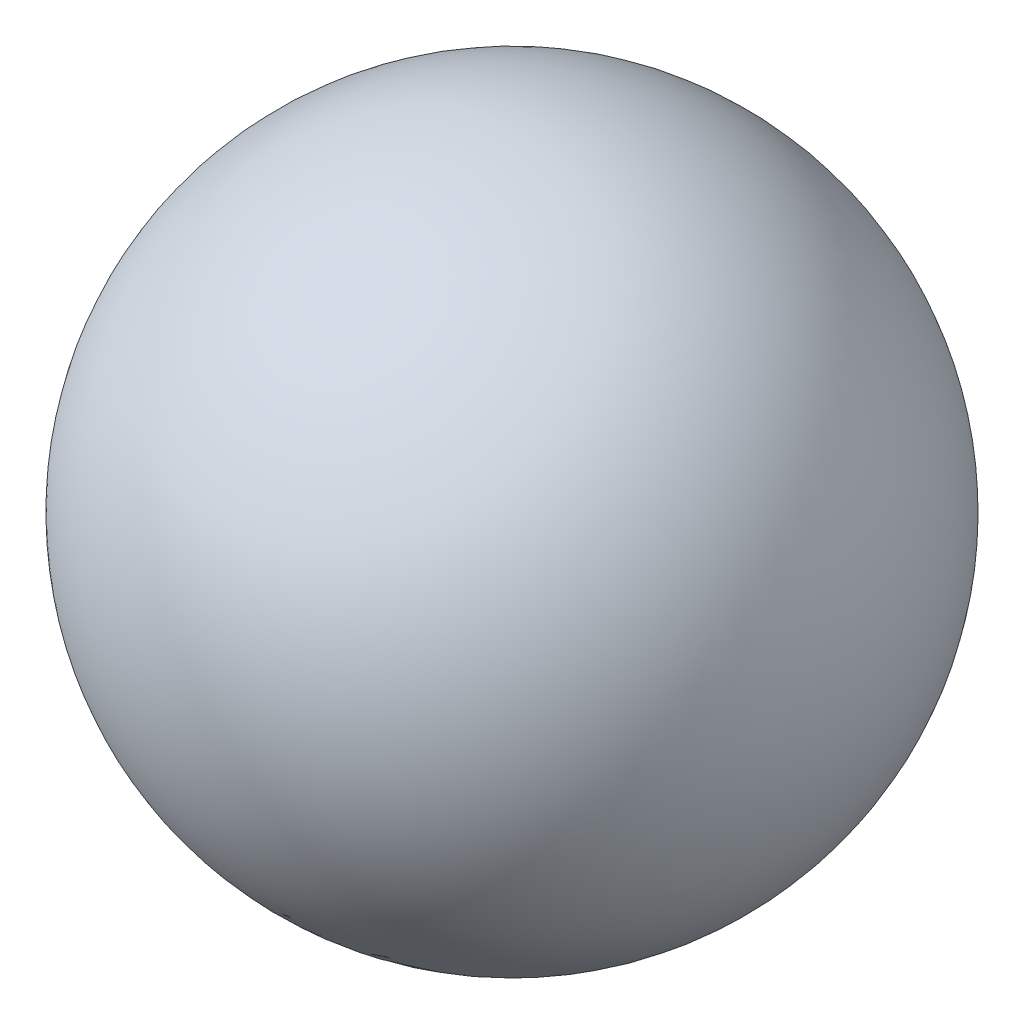
ISO-10303-21;
HEADER;
FILE_DESCRIPTION(('STEP AP214'),'2;1');
FILE_NAME('part.step','',(''),(''),'','','');
FILE_SCHEMA(('AUTOMOTIVE_DESIGN { 1 0 10303 214 1 1 1 1 }'));
ENDSEC;
DATA;
#1=APPLICATION_CONTEXT('core data for automotive mechanical design processes');
#2=APPLICATION_PROTOCOL_DEFINITION('international standard','automotive_design',2000,#1);
#3=PRODUCT_CONTEXT('',#1,'mechanical');
#4=PRODUCT('Part','Part','',(#3));
#5=PRODUCT_RELATED_PRODUCT_CATEGORY('part','',(#4));
#6=PRODUCT_DEFINITION_FORMATION('','',#4);
#7=PRODUCT_DEFINITION_CONTEXT('part definition',#1,'design');
#8=PRODUCT_DEFINITION('design','',#6,#7);
#9=PRODUCT_DEFINITION_SHAPE('','',#8);
#10=(LENGTH_UNIT() NAMED_UNIT(*) SI_UNIT(.MILLI.,.METRE.));
#11=(NAMED_UNIT(*) PLANE_ANGLE_UNIT() SI_UNIT($,.RADIAN.));
#12=(NAMED_UNIT(*) SI_UNIT($,.STERADIAN.) SOLID_ANGLE_UNIT());
#13=UNCERTAINTY_MEASURE_WITH_UNIT(LENGTH_MEASURE(1.E-05),#10,'distance_accuracy_value','');
#14=(GEOMETRIC_REPRESENTATION_CONTEXT(3) GLOBAL_UNCERTAINTY_ASSIGNED_CONTEXT((#13)) GLOBAL_UNIT_ASSIGNED_CONTEXT((#10,
#11,#12)) REPRESENTATION_CONTEXT('',''));
#15=CARTESIAN_POINT('',(0.,0.,0.));
#16=DIRECTION('',(0.,0.,1.));
#17=DIRECTION('',(1.,0.,0.));
#18=AXIS2_PLACEMENT_3D('',#15,#16,#17);
#19=CARTESIAN_POINT('',(64.16,27.0858634108856,63.8776697468439));
#20=DIRECTION('',(0.,0.390381842971414,0.920653038162718));
#21=DIRECTION('',(0.173648177666934,-0.906666249816888,0.384451065593442));
#22=AXIS2_PLACEMENT_3D('',#19,#20,#21);
#23=SPHERICAL_SURFACE('',#22,7.15);
#24=CARTESIAN_POINT('',(64.16,29.8770935881312,70.4603389697073));
#25=VERTEX_POINT('',#24);
#26=VERTEX_LOOP('',#25);
#27=FACE_BOUND('',#26,.T.);
#28=CARTESIAN_POINT('',(64.16,24.29463323364,57.2950005239805));
#29=VERTEX_POINT('',#28);
#30=VERTEX_LOOP('',#29);
#31=FACE_BOUND('',#30,.T.);
#32=ADVANCED_FACE('F16',(#27,#31),#23,.T.);
#33=CLOSED_SHELL('',(#32));
#34=MANIFOLD_SOLID_BREP('B1',#33);
#35=ADVANCED_BREP_SHAPE_REPRESENTATION('',(#18,#34),#14);
#36=SHAPE_DEFINITION_REPRESENTATION(#9,#35);
ENDSEC;
END-ISO-10303-21;
